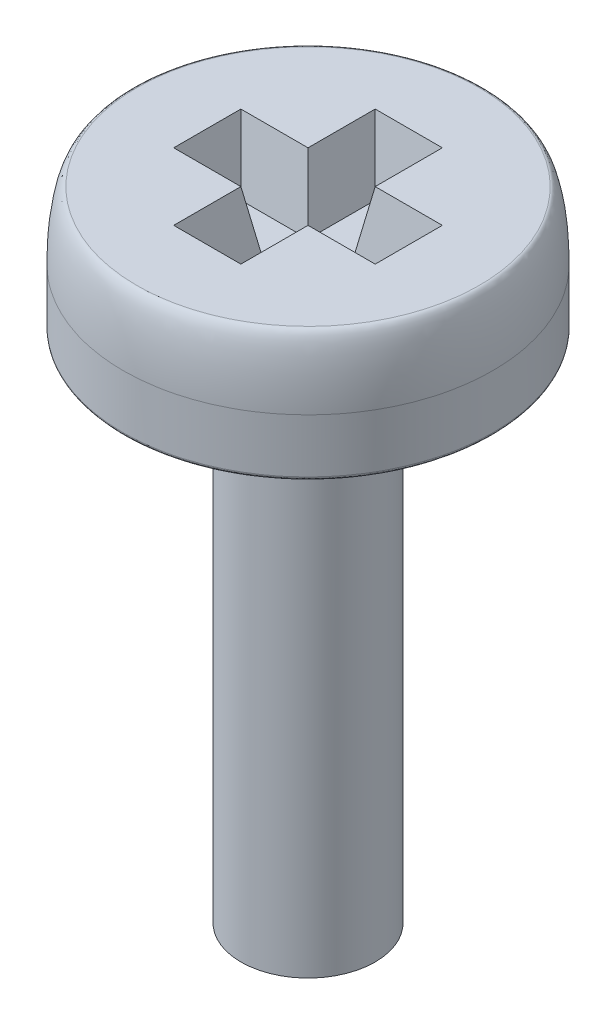
ISO-10303-21;
HEADER;
FILE_DESCRIPTION(('STEP AP214'),'2;1');
FILE_NAME('part.step','',(''),(''),'','','');
FILE_SCHEMA(('AUTOMOTIVE_DESIGN { 1 0 10303 214 1 1 1 1 }'));
ENDSEC;
DATA;
#1=APPLICATION_CONTEXT('core data for automotive mechanical design processes');
#2=APPLICATION_PROTOCOL_DEFINITION('international standard','automotive_design',2000,#1);
#3=PRODUCT_CONTEXT('',#1,'mechanical');
#4=PRODUCT('Part','Part','',(#3));
#5=PRODUCT_RELATED_PRODUCT_CATEGORY('part','',(#4));
#6=PRODUCT_DEFINITION_FORMATION('','',#4);
#7=PRODUCT_DEFINITION_CONTEXT('part definition',#1,'design');
#8=PRODUCT_DEFINITION('design','',#6,#7);
#9=PRODUCT_DEFINITION_SHAPE('','',#8);
#10=(LENGTH_UNIT() NAMED_UNIT(*) SI_UNIT(.MILLI.,.METRE.));
#11=(NAMED_UNIT(*) PLANE_ANGLE_UNIT() SI_UNIT($,.RADIAN.));
#12=(NAMED_UNIT(*) SI_UNIT($,.STERADIAN.) SOLID_ANGLE_UNIT());
#13=UNCERTAINTY_MEASURE_WITH_UNIT(LENGTH_MEASURE(1.E-05),#10,'distance_accuracy_value','');
#14=(GEOMETRIC_REPRESENTATION_CONTEXT(3) GLOBAL_UNCERTAINTY_ASSIGNED_CONTEXT((#13)) GLOBAL_UNIT_ASSIGNED_CONTEXT((#10,
#11,#12)) REPRESENTATION_CONTEXT('',''));
#15=CARTESIAN_POINT('',(0.,0.,0.));
#16=DIRECTION('',(0.,0.,1.));
#17=DIRECTION('',(1.,0.,0.));
#18=AXIS2_PLACEMENT_3D('',#15,#16,#17);
#19=CARTESIAN_POINT('',(0.,2.,0.));
#20=DIRECTION('',(0.,-1.,0.));
#21=DIRECTION('',(0.,0.,-1.));
#22=AXIS2_PLACEMENT_3D('',#19,#20,#21);
#23=CYLINDRICAL_SURFACE('',#22,2.75);
#24=CARTESIAN_POINT('',(0.,1.,2.75));
#25=CARTESIAN_POINT('',(0.359974148997221,1.,2.75));
#26=CARTESIAN_POINT('',(0.719806690512289,1.,2.678424857307));
#27=CARTESIAN_POINT('',(1.3849521874957,1.,2.40291257150508));
#28=CARTESIAN_POINT('',(1.6900034864552,1.,2.19908381007081));
#29=CARTESIAN_POINT('',(2.19908381007081,1.,1.6900034864552));
#30=CARTESIAN_POINT('',(2.40291257150507,1.,1.38495218749572));
#31=CARTESIAN_POINT('',(2.67842485730701,1.,0.719806690512269));
#32=CARTESIAN_POINT('',(2.75,1.,0.359974148997273));
#33=CARTESIAN_POINT('',(2.75,1.,-0.359974148997272));
#34=CARTESIAN_POINT('',(2.67842485730702,1.,-0.71980669051224));
#35=CARTESIAN_POINT('',(2.40291257150506,1.,-1.38495218749576));
#36=CARTESIAN_POINT('',(2.19908381007078,1.,-1.69000348645523));
#37=CARTESIAN_POINT('',(1.69000348645523,1.,-2.19908381007078));
#38=CARTESIAN_POINT('',(1.38495218749573,1.,-2.40291257150507));
#39=CARTESIAN_POINT('',(0.719806690512274,1.,-2.67842485730701));
#40=CARTESIAN_POINT('',(0.359974148997273,1.,-2.75));
#41=CARTESIAN_POINT('',(-0.359974148997272,1.,-2.75));
#42=CARTESIAN_POINT('',(-0.719806690512236,1.,-2.67842485730702));
#43=CARTESIAN_POINT('',(-1.38495218749575,1.,-2.40291257150506));
#44=CARTESIAN_POINT('',(-1.6900034864552,1.,-2.19908381007081));
#45=CARTESIAN_POINT('',(-2.19908381007082,1.,-1.69000348645519));
#46=CARTESIAN_POINT('',(-2.40291257150506,1.,-1.38495218749574));
#47=CARTESIAN_POINT('',(-2.67842485730701,1.,-0.719806690512258));
#48=CARTESIAN_POINT('',(-2.75,1.,-0.359974148997269));
#49=CARTESIAN_POINT('',(-2.75,1.,0.359974148997277));
#50=CARTESIAN_POINT('',(-2.67842485730702,1.,0.719806690512249));
#51=CARTESIAN_POINT('',(-2.40291257150506,1.,1.38495218749574));
#52=CARTESIAN_POINT('',(-2.1990838100708,1.,1.69000348645521));
#53=CARTESIAN_POINT('',(-1.69000348645522,1.,2.19908381007079));
#54=CARTESIAN_POINT('',(-1.38495218749574,1.,2.40291257150506));
#55=CARTESIAN_POINT('',(-0.719806690512258,1.,2.67842485730701));
#56=CARTESIAN_POINT('',(-0.359974148997222,1.,2.75));
#57=CARTESIAN_POINT('',(0.,1.,2.75));
#58=(BOUNDED_CURVE() B_SPLINE_CURVE(3,(#24,#25,#26,#27,#28,#29,#30,#31,#32,#33,#34,#35,#36,#37,
#38,#39,#40,#41,#42,#43,#44,#45,#46,#47,#48,#49,#50,#51,#52,#53,#54,#55,#56,#57),.UNSPECIFIED.,
.T.,.F.) B_SPLINE_CURVE_WITH_KNOTS((4,2,2,2,2,2,2,2,2,2,2,2,2,2,2,2,4),(0.,0.392699081698724,
0.785398163397448,1.17809724509617,1.5707963267949,1.96349540849362,2.35619449019234,
2.74889357189107,3.14159265358979,3.53429173528852,3.92699081698724,4.31968989868597,
4.71238898038469,5.10508806208341,5.49778714378214,5.89048622548086,6.28318530717959),
.UNSPECIFIED.) CURVE() GEOMETRIC_REPRESENTATION_ITEM() RATIONAL_B_SPLINE_CURVE((1.,1.,1.,1.,1.,
1.,1.,1.,1.,1.,1.,1.,1.,1.,1.,1.,1.,1.,1.,1.,1.,1.,1.,1.,1.,1.,1.,1.,1.,1.,1.,1.,1.,1.)) REPRESENTATION_ITEM(''));
#59=CARTESIAN_POINT('',(0.,1.,2.75));
#60=VERTEX_POINT('',#59);
#61=EDGE_CURVE('E337',#60,#60,#58,.F.);
#62=ORIENTED_EDGE('',*,*,#61,.T.);
#63=EDGE_LOOP('',(#62));
#64=FACE_BOUND('',#63,.T.);
#65=CARTESIAN_POINT('',(0.,0.2,2.75));
#66=CARTESIAN_POINT('',(-0.359974138633578,0.2,2.75));
#67=CARTESIAN_POINT('',(-0.71980670008718,0.2,2.67842485334095));
#68=CARTESIAN_POINT('',(-1.38495217792082,0.2,2.40291257547112));
#69=CARTESIAN_POINT('',(-1.69000349378355,0.2,2.19908380274246));
#70=CARTESIAN_POINT('',(-2.19908380274247,0.2,1.69000349378354));
#71=CARTESIAN_POINT('',(-2.40291257547116,0.2,1.38495217792074));
#72=CARTESIAN_POINT('',(-2.67842485334092,0.2,0.719806700087249));
#73=CARTESIAN_POINT('',(-2.75,0.2,0.359974138633405));
#74=CARTESIAN_POINT('',(-2.75,0.2,-0.359974138633396));
#75=CARTESIAN_POINT('',(-2.67842485334093,0.2,-0.719806700087222));
#76=CARTESIAN_POINT('',(-2.40291257547114,0.2,-1.38495217792078));
#77=CARTESIAN_POINT('',(-2.19908380274248,0.2,-1.69000349378353));
#78=CARTESIAN_POINT('',(-1.69000349378354,0.2,-2.19908380274248));
#79=CARTESIAN_POINT('',(-1.38495217792079,0.2,-2.40291257547114));
#80=CARTESIAN_POINT('',(-0.719806700087199,0.2,-2.67842485334094));
#81=CARTESIAN_POINT('',(-0.3599741386334,0.2,-2.75));
#82=CARTESIAN_POINT('',(0.359974138633401,0.2,-2.75));
#83=CARTESIAN_POINT('',(0.719806700087225,0.2,-2.67842485334093));
#84=CARTESIAN_POINT('',(1.38495217792078,0.2,-2.40291257547114));
#85=CARTESIAN_POINT('',(1.69000349378355,0.2,-2.19908380274247));
#86=CARTESIAN_POINT('',(2.19908380274246,0.2,-1.69000349378355));
#87=CARTESIAN_POINT('',(2.40291257547113,0.2,-1.3849521779208));
#88=CARTESIAN_POINT('',(2.67842485334095,0.2,-0.719806700087193));
#89=CARTESIAN_POINT('',(2.75,0.2,-0.3599741386334));
#90=CARTESIAN_POINT('',(2.75,0.2,0.3599741386334));
#91=CARTESIAN_POINT('',(2.67842485334094,0.2,0.719806700087204));
#92=CARTESIAN_POINT('',(2.40291257547114,0.2,1.38495217792079));
#93=CARTESIAN_POINT('',(2.19908380274249,0.2,1.69000349378352));
#94=CARTESIAN_POINT('',(1.69000349378352,0.2,2.19908380274249));
#95=CARTESIAN_POINT('',(1.38495217792077,0.2,2.40291257547114));
#96=CARTESIAN_POINT('',(0.719806700087226,0.2,2.67842485334093));
#97=CARTESIAN_POINT('',(0.359974138633578,0.2,2.75));
#98=CARTESIAN_POINT('',(0.,0.2,2.75));
#99=(BOUNDED_CURVE() B_SPLINE_CURVE(3,(#65,#66,#67,#68,#69,#70,#71,#72,#73,#74,#75,#76,#77,#78,
#79,#80,#81,#82,#83,#84,#85,#86,#87,#88,#89,#90,#91,#92,#93,#94,#95,#96,#97,#98),.UNSPECIFIED.,
.T.,.F.) B_SPLINE_CURVE_WITH_KNOTS((4,2,2,2,2,2,2,2,2,2,2,2,2,2,2,2,4),(0.,0.392699081698725,
0.785398163397448,1.17809724509617,1.5707963267949,1.96349540849362,2.35619449019234,
2.74889357189107,3.14159265358979,3.53429173528852,3.92699081698724,4.31968989868597,
4.71238898038469,5.10508806208341,5.49778714378214,5.89048622548086,6.28318530717959),
.UNSPECIFIED.) CURVE() GEOMETRIC_REPRESENTATION_ITEM() RATIONAL_B_SPLINE_CURVE((1.,1.,1.,1.,1.,
1.,1.,1.,1.,1.,1.,1.,1.,1.,1.,1.,1.,1.,1.,1.,1.,1.,1.,1.,1.,1.,1.,1.,1.,1.,1.,1.,1.,1.)) REPRESENTATION_ITEM(''));
#100=CARTESIAN_POINT('',(0.,0.2,2.75));
#101=VERTEX_POINT('',#100);
#102=EDGE_CURVE('E318',#101,#101,#99,.F.);
#103=ORIENTED_EDGE('',*,*,#102,.T.);
#104=EDGE_LOOP('',(#103));
#105=FACE_BOUND('',#104,.T.);
#106=ADVANCED_FACE('F41',(#64,#105),#23,.T.);
#107=CARTESIAN_POINT('',(0.,2.,0.));
#108=DIRECTION('',(0.,1.,0.));
#109=DIRECTION('',(0.,0.,1.));
#110=AXIS2_PLACEMENT_3D('',#107,#108,#109);
#111=PLANE('',#110);
#112=DIRECTION('',(0.,0.,-1.));
#113=VECTOR('',#112,1.);
#114=CARTESIAN_POINT('',(0.5,2.,-1.5));
#115=LINE('',#114,#113);
#116=CARTESIAN_POINT('',(0.5,2.,-0.5));
#117=VERTEX_POINT('',#116);
#118=CARTESIAN_POINT('',(0.5,2.,-1.5));
#119=VERTEX_POINT('',#118);
#120=EDGE_CURVE('E60',#117,#119,#115,.T.);
#121=ORIENTED_EDGE('',*,*,#120,.F.);
#122=DIRECTION('',(-1.,0.,0.));
#123=VECTOR('',#122,1.);
#124=CARTESIAN_POINT('',(0.5,2.,-0.5));
#125=LINE('',#124,#123);
#126=CARTESIAN_POINT('',(1.5,2.,-0.5));
#127=VERTEX_POINT('',#126);
#128=EDGE_CURVE('E185',#127,#117,#125,.T.);
#129=ORIENTED_EDGE('',*,*,#128,.F.);
#130=DIRECTION('',(0.,0.,-1.));
#131=VECTOR('',#130,1.);
#132=CARTESIAN_POINT('',(1.5,2.,-0.5));
#133=LINE('',#132,#131);
#134=CARTESIAN_POINT('',(1.5,2.,0.5));
#135=VERTEX_POINT('',#134);
#136=EDGE_CURVE('E183',#135,#127,#133,.T.);
#137=ORIENTED_EDGE('',*,*,#136,.F.);
#138=DIRECTION('',(1.,0.,0.));
#139=VECTOR('',#138,1.);
#140=CARTESIAN_POINT('',(0.5,2.,0.5));
#141=LINE('',#140,#139);
#142=CARTESIAN_POINT('',(0.5,2.,0.5));
#143=VERTEX_POINT('',#142);
#144=EDGE_CURVE('E180',#143,#135,#141,.T.);
#145=ORIENTED_EDGE('',*,*,#144,.F.);
#146=DIRECTION('',(0.,0.,-1.));
#147=VECTOR('',#146,1.);
#148=CARTESIAN_POINT('',(0.5,2.,0.5));
#149=LINE('',#148,#147);
#150=CARTESIAN_POINT('',(0.5,2.,1.5));
#151=VERTEX_POINT('',#150);
#152=EDGE_CURVE('E177',#151,#143,#149,.T.);
#153=ORIENTED_EDGE('',*,*,#152,.F.);
#154=DIRECTION('',(1.,0.,0.));
#155=VECTOR('',#154,1.);
#156=CARTESIAN_POINT('',(0.5,2.,1.5));
#157=LINE('',#156,#155);
#158=CARTESIAN_POINT('',(-0.5,2.,1.5));
#159=VERTEX_POINT('',#158);
#160=EDGE_CURVE('E174',#159,#151,#157,.T.);
#161=ORIENTED_EDGE('',*,*,#160,.F.);
#162=DIRECTION('',(0.,0.,1.));
#163=VECTOR('',#162,1.);
#164=CARTESIAN_POINT('',(-0.5,2.,0.5));
#165=LINE('',#164,#163);
#166=CARTESIAN_POINT('',(-0.5,2.,0.5));
#167=VERTEX_POINT('',#166);
#168=EDGE_CURVE('E171',#167,#159,#165,.T.);
#169=ORIENTED_EDGE('',*,*,#168,.F.);
#170=DIRECTION('',(1.,0.,0.));
#171=VECTOR('',#170,1.);
#172=CARTESIAN_POINT('',(-1.5,2.,0.5));
#173=LINE('',#172,#171);
#174=CARTESIAN_POINT('',(-1.5,2.,0.5));
#175=VERTEX_POINT('',#174);
#176=EDGE_CURVE('E168',#175,#167,#173,.T.);
#177=ORIENTED_EDGE('',*,*,#176,.F.);
#178=DIRECTION('',(0.,0.,1.));
#179=VECTOR('',#178,1.);
#180=CARTESIAN_POINT('',(-1.5,2.,-0.5));
#181=LINE('',#180,#179);
#182=CARTESIAN_POINT('',(-1.5,2.,-0.5));
#183=VERTEX_POINT('',#182);
#184=EDGE_CURVE('E162',#183,#175,#181,.T.);
#185=ORIENTED_EDGE('',*,*,#184,.F.);
#186=DIRECTION('',(-1.,0.,0.));
#187=VECTOR('',#186,1.);
#188=CARTESIAN_POINT('',(-1.5,2.,-0.5));
#189=LINE('',#188,#187);
#190=CARTESIAN_POINT('',(-0.5,2.,-0.5));
#191=VERTEX_POINT('',#190);
#192=EDGE_CURVE('E160',#191,#183,#189,.T.);
#193=ORIENTED_EDGE('',*,*,#192,.F.);
#194=DIRECTION('',(0.,0.,1.));
#195=VECTOR('',#194,1.);
#196=CARTESIAN_POINT('',(-0.5,2.,-1.5));
#197=LINE('',#196,#195);
#198=CARTESIAN_POINT('',(-0.5,2.,-1.5));
#199=VERTEX_POINT('',#198);
#200=EDGE_CURVE('E143',#199,#191,#197,.T.);
#201=ORIENTED_EDGE('',*,*,#200,.F.);
#202=DIRECTION('',(-1.,0.,0.));
#203=VECTOR('',#202,1.);
#204=CARTESIAN_POINT('',(0.5,2.,-1.5));
#205=LINE('',#204,#203);
#206=EDGE_CURVE('E152',#119,#199,#205,.T.);
#207=ORIENTED_EDGE('',*,*,#206,.F.);
#208=EDGE_LOOP('',(#121,#129,#137,#145,#153,#161,#169,#177,#185,#193,#201,#207));
#209=FACE_BOUND('',#208,.T.);
#210=CARTESIAN_POINT('',(0.,2.,2.55));
#211=CARTESIAN_POINT('',(-0.333794210888333,2.,2.55));
#212=CARTESIAN_POINT('',(-0.667457113020464,2.,2.48363032223014));
#213=CARTESIAN_POINT('',(-1.2842283920415,2.,2.22815529357742));
#214=CARTESIAN_POINT('',(-1.56709414198576,2.,2.03915044206566));
#215=CARTESIAN_POINT('',(-2.03915044206564,2.,1.56709414198572));
#216=CARTESIAN_POINT('',(-2.22815529357742,2.,1.28422839204149));
#217=CARTESIAN_POINT('',(-2.48363032223015,2.,0.667457113020457));
#218=CARTESIAN_POINT('',(-2.55,2.,0.333794210888384));
#219=CARTESIAN_POINT('',(-2.55,2.,-0.333794210888376));
#220=CARTESIAN_POINT('',(-2.48363032223014,2.,-0.667457113020464));
#221=CARTESIAN_POINT('',(-2.22815529357742,2.,-1.2842283920415));
#222=CARTESIAN_POINT('',(-2.03915044206569,2.,-1.56709414198573));
#223=CARTESIAN_POINT('',(-1.5670941419857,2.,-2.03915044206566));
#224=CARTESIAN_POINT('',(-1.28422839204151,2.,-2.22815529357742));
#225=CARTESIAN_POINT('',(-0.667457113020445,2.,-2.48363032223015));
#226=CARTESIAN_POINT('',(-0.33379421088838,2.,-2.55));
#227=CARTESIAN_POINT('',(0.33379421088838,2.,-2.55));
#228=CARTESIAN_POINT('',(0.66745711302047,2.,-2.48363032223014));
#229=CARTESIAN_POINT('',(1.28422839204149,2.,-2.22815529357742));
#230=CARTESIAN_POINT('',(1.56709414198577,2.,-2.03915044206566));
#231=CARTESIAN_POINT('',(2.03915044206562,2.,-1.56709414198574));
#232=CARTESIAN_POINT('',(2.22815529357742,2.,-1.28422839204153));
#233=CARTESIAN_POINT('',(2.48363032223014,2.,-0.667457113020431));
#234=CARTESIAN_POINT('',(2.55,2.,-0.33379421088838));
#235=CARTESIAN_POINT('',(2.55,2.,0.33379421088838));
#236=CARTESIAN_POINT('',(2.48363032223014,2.,0.667457113020465));
#237=CARTESIAN_POINT('',(2.22815529357742,2.,1.28422839204149));
#238=CARTESIAN_POINT('',(2.03915044206569,2.,1.56709414198574));
#239=CARTESIAN_POINT('',(1.5670941419857,2.,2.03915044206565));
#240=CARTESIAN_POINT('',(1.28422839204149,2.,2.22815529357745));
#241=CARTESIAN_POINT('',(0.667457113020469,2.,2.48363032223011));
#242=CARTESIAN_POINT('',(0.333794210888332,2.,2.55));
#243=CARTESIAN_POINT('',(0.,2.,2.55));
#244=(BOUNDED_CURVE() B_SPLINE_CURVE(3,(#210,#211,#212,#213,#214,#215,#216,#217,#218,#219,#220,
#221,#222,#223,#224,#225,#226,#227,#228,#229,#230,#231,#232,#233,#234,#235,#236,#237,#238,#239,
#240,#241,#242,#243),.UNSPECIFIED.,.T.,.F.) B_SPLINE_CURVE_WITH_KNOTS((4,2,2,2,2,2,2,2,2,2,2,2,
2,2,2,2,4),(0.,0.392699081698725,0.785398163397448,1.17809724509617,1.5707963267949,
1.96349540849362,2.35619449019234,2.74889357189107,3.14159265358979,3.53429173528852,
3.92699081698724,4.31968989868597,4.71238898038469,5.10508806208341,5.49778714378214,
5.89048622548086,6.28318530717959),
.UNSPECIFIED.) CURVE() GEOMETRIC_REPRESENTATION_ITEM() RATIONAL_B_SPLINE_CURVE((1.,1.,1.,1.,1.,
1.,1.,1.,1.,1.,1.,1.,1.,1.,1.,1.,1.,1.,1.,1.,1.,1.,1.,1.,1.,1.,1.,1.,1.,1.,1.,1.,1.,1.)) REPRESENTATION_ITEM(''));
#245=CARTESIAN_POINT('',(0.,2.,2.55));
#246=VERTEX_POINT('',#245);
#247=EDGE_CURVE('E241',#246,#246,#244,.F.);
#248=ORIENTED_EDGE('',*,*,#247,.T.);
#249=EDGE_LOOP('',(#248));
#250=FACE_BOUND('',#249,.T.);
#251=ADVANCED_FACE('F156',(#209,#250),#111,.T.);
#252=CARTESIAN_POINT('',(0.,0.,0.));
#253=DIRECTION('',(0.,1.,0.));
#254=DIRECTION('',(0.,0.,1.));
#255=AXIS2_PLACEMENT_3D('',#252,#253,#254);
#256=PLANE('',#255);
#257=CARTESIAN_POINT('',(0.,0.,0.));
#258=DIRECTION('',(0.,1.,0.));
#259=DIRECTION('',(0.,0.,1.));
#260=AXIS2_PLACEMENT_3D('',#257,#258,#259);
#261=CIRCLE('',#260,1.);
#262=CARTESIAN_POINT('',(0.,0.,1.));
#263=VERTEX_POINT('',#262);
#264=EDGE_CURVE('E12',#263,#263,#261,.F.);
#265=ORIENTED_EDGE('',*,*,#264,.F.);
#266=EDGE_LOOP('',(#265));
#267=FACE_BOUND('',#266,.T.);
#268=CARTESIAN_POINT('',(0.,0.,1.75));
#269=CARTESIAN_POINT('',(0.229074451857731,0.,1.75));
#270=CARTESIAN_POINT('',(0.45805880914641,0.,1.70445217939875));
#271=CARTESIAN_POINT('',(0.881333204131404,0.,1.52912618439075));
#272=CARTESIAN_POINT('',(1.07545676877133,0.,1.39941696538156));
#273=CARTESIAN_POINT('',(1.39941696538159,0.,1.07545676877135));
#274=CARTESIAN_POINT('',(1.52912618439074,0.,0.881333204131412));
#275=CARTESIAN_POINT('',(1.70445217939876,0.,0.458058809146401));
#276=CARTESIAN_POINT('',(1.75,0.,0.229074451857619));
#277=CARTESIAN_POINT('',(1.75,0.,-0.229074451857618));
#278=CARTESIAN_POINT('',(1.70445217939879,0.,-0.458058809146415));
#279=CARTESIAN_POINT('',(1.52912618439072,0.,-0.881333204131401));
#280=CARTESIAN_POINT('',(1.39941696538157,0.,-1.07545676877135));
#281=CARTESIAN_POINT('',(1.07545676877135,0.,-1.39941696538157));
#282=CARTESIAN_POINT('',(0.88133320413141,0.,-1.52912618439073));
#283=CARTESIAN_POINT('',(0.458058809146409,0.,-1.70445217939877));
#284=CARTESIAN_POINT('',(0.229074451857619,0.,-1.75));
#285=CARTESIAN_POINT('',(-0.229074451857618,0.,-1.75));
#286=CARTESIAN_POINT('',(-0.458058809146404,0.,-1.70445217939877));
#287=CARTESIAN_POINT('',(-0.881333204131405,0.,-1.52912618439073));
#288=CARTESIAN_POINT('',(-1.07545676877135,0.,-1.39941696538157));
#289=CARTESIAN_POINT('',(-1.39941696538157,0.,-1.07545676877135));
#290=CARTESIAN_POINT('',(-1.52912618439072,0.,-0.881333204131394));
#291=CARTESIAN_POINT('',(-1.70445217939878,0.,-0.458058809146424));
#292=CARTESIAN_POINT('',(-1.75,0.,-0.229074451857616));
#293=CARTESIAN_POINT('',(-1.75,0.,0.229074451857621));
#294=CARTESIAN_POINT('',(-1.70445217939878,0.,0.458058809146419));
#295=CARTESIAN_POINT('',(-1.52912618439073,0.,0.881333204131389));
#296=CARTESIAN_POINT('',(-1.39941696538157,0.,1.07545676877135));
#297=CARTESIAN_POINT('',(-1.07545676877135,0.,1.39941696538156));
#298=CARTESIAN_POINT('',(-0.881333204131419,0.,1.52912618439072));
#299=CARTESIAN_POINT('',(-0.458058809146399,0.,1.70445217939878));
#300=CARTESIAN_POINT('',(-0.229074451857731,0.,1.75));
#301=CARTESIAN_POINT('',(0.,0.,1.75));
#302=(BOUNDED_CURVE() B_SPLINE_CURVE(3,(#268,#269,#270,#271,#272,#273,#274,#275,#276,#277,#278,
#279,#280,#281,#282,#283,#284,#285,#286,#287,#288,#289,#290,#291,#292,#293,#294,#295,#296,#297,
#298,#299,#300,#301),.UNSPECIFIED.,.T.,.F.) B_SPLINE_CURVE_WITH_KNOTS((4,2,2,2,2,2,2,2,2,2,2,2,
2,2,2,2,4),(0.,0.392699081698724,0.785398163397448,1.17809724509617,1.5707963267949,
1.96349540849362,2.35619449019234,2.74889357189107,3.14159265358979,3.53429173528852,
3.92699081698724,4.31968989868597,4.71238898038469,5.10508806208341,5.49778714378214,
5.89048622548086,6.28318530717959),
.UNSPECIFIED.) CURVE() GEOMETRIC_REPRESENTATION_ITEM() RATIONAL_B_SPLINE_CURVE((1.,1.,1.,1.,1.,
1.,1.,1.,1.,1.,1.,1.,1.,1.,1.,1.,1.,1.,1.,1.,1.,1.,1.,1.,1.,1.,1.,1.,1.,1.,1.,1.,1.,1.)) REPRESENTATION_ITEM(''));
#303=CARTESIAN_POINT('',(0.,0.,1.75));
#304=VERTEX_POINT('',#303);
#305=EDGE_CURVE('E53',#304,#304,#302,.F.);
#306=ORIENTED_EDGE('',*,*,#305,.T.);
#307=EDGE_LOOP('',(#306));
#308=FACE_BOUND('',#307,.T.);
#309=ADVANCED_FACE('F260',(#267,#308),#256,.F.);
#310=CARTESIAN_POINT('',(0.,2.,2.55));
#311=CARTESIAN_POINT('',(0.333794210888332,2.,2.55));
#312=CARTESIAN_POINT('',(0.667457113020469,2.,2.48363032223011));
#313=CARTESIAN_POINT('',(1.28422839204149,2.,2.22815529357745));
#314=CARTESIAN_POINT('',(1.5670941419857,2.,2.03915044206565));
#315=CARTESIAN_POINT('',(2.03915044206569,2.,1.56709414198574));
#316=CARTESIAN_POINT('',(2.22815529357742,2.,1.28422839204149));
#317=CARTESIAN_POINT('',(2.48363032223014,2.,0.667457113020465));
#318=CARTESIAN_POINT('',(2.55,2.,0.33379421088838));
#319=CARTESIAN_POINT('',(2.55,2.,-0.33379421088838));
#320=CARTESIAN_POINT('',(2.48363032223014,2.,-0.667457113020431));
#321=CARTESIAN_POINT('',(2.22815529357742,2.,-1.28422839204153));
#322=CARTESIAN_POINT('',(2.03915044206562,2.,-1.56709414198574));
#323=CARTESIAN_POINT('',(1.56709414198577,2.,-2.03915044206566));
#324=CARTESIAN_POINT('',(1.28422839204149,2.,-2.22815529357742));
#325=CARTESIAN_POINT('',(0.66745711302047,2.,-2.48363032223014));
#326=CARTESIAN_POINT('',(0.33379421088838,2.,-2.55));
#327=CARTESIAN_POINT('',(-0.33379421088838,2.,-2.55));
#328=CARTESIAN_POINT('',(-0.667457113020445,2.,-2.48363032223015));
#329=CARTESIAN_POINT('',(-1.28422839204151,2.,-2.22815529357742));
#330=CARTESIAN_POINT('',(-1.5670941419857,2.,-2.03915044206566));
#331=CARTESIAN_POINT('',(-2.03915044206569,2.,-1.56709414198573));
#332=CARTESIAN_POINT('',(-2.22815529357742,2.,-1.2842283920415));
#333=CARTESIAN_POINT('',(-2.48363032223014,2.,-0.667457113020464));
#334=CARTESIAN_POINT('',(-2.55,2.,-0.333794210888376));
#335=CARTESIAN_POINT('',(-2.55,2.,0.333794210888384));
#336=CARTESIAN_POINT('',(-2.48363032223015,2.,0.667457113020457));
#337=CARTESIAN_POINT('',(-2.22815529357742,2.,1.28422839204149));
#338=CARTESIAN_POINT('',(-2.03915044206564,2.,1.56709414198572));
#339=CARTESIAN_POINT('',(-1.56709414198576,2.,2.03915044206566));
#340=CARTESIAN_POINT('',(-1.2842283920415,2.,2.22815529357742));
#341=CARTESIAN_POINT('',(-0.667457113020464,2.,2.48363032223014));
#342=CARTESIAN_POINT('',(-0.333794210888333,2.,2.55));
#343=CARTESIAN_POINT('',(0.,2.,2.55));
#344=CARTESIAN_POINT('',(0.,2.,2.75));
#345=CARTESIAN_POINT('',(0.359974148997221,1.99999999999986,2.75));
#346=CARTESIAN_POINT('',(0.719806690512251,2.,2.67842485730691));
#347=CARTESIAN_POINT('',(1.38495218749574,2.,2.40291257150517));
#348=CARTESIAN_POINT('',(1.69000348645521,2.,2.1990838100708));
#349=CARTESIAN_POINT('',(2.1990838100708,2.,1.69000348645521));
#350=CARTESIAN_POINT('',(2.40291257150506,2.,1.38495218749572));
#351=CARTESIAN_POINT('',(2.67842485730702,2.,0.719806690512272));
#352=CARTESIAN_POINT('',(2.75,2.,0.359974148997273));
#353=CARTESIAN_POINT('',(2.75,2.,-0.359974148997272));
#354=CARTESIAN_POINT('',(2.67842485730701,2.,-0.719806690512238));
#355=CARTESIAN_POINT('',(2.40291257150506,2.,-1.38495218749576));
#356=CARTESIAN_POINT('',(2.19908381007076,2.,-1.69000348645518));
#357=CARTESIAN_POINT('',(1.69000348645525,2.,-2.19908381007083));
#358=CARTESIAN_POINT('',(1.38495218749572,2.,-2.40291257150506));
#359=CARTESIAN_POINT('',(0.719806690512277,2.,-2.67842485730701));
#360=CARTESIAN_POINT('',(0.359974148997273,2.,-2.75));
#361=CARTESIAN_POINT('',(-0.359974148997272,2.,-2.75));
#362=CARTESIAN_POINT('',(-0.719806690512233,2.,-2.67842485730702));
#363=CARTESIAN_POINT('',(-1.38495218749575,2.,-2.40291257150506));
#364=CARTESIAN_POINT('',(-1.69000348645518,2.,-2.1990838100708));
#365=CARTESIAN_POINT('',(-2.19908381007083,2.,-1.69000348645521));
#366=CARTESIAN_POINT('',(-2.40291257150505,2.,-1.38495218749574));
#367=CARTESIAN_POINT('',(-2.67842485730702,2.,-0.719806690512262));
#368=CARTESIAN_POINT('',(-2.75,2.,-0.359974148997269));
#369=CARTESIAN_POINT('',(-2.75,2.,0.359974148997277));
#370=CARTESIAN_POINT('',(-2.67842485730703,2.,0.719806690512254));
#371=CARTESIAN_POINT('',(-2.40291257150505,2.,1.38495218749573));
#372=CARTESIAN_POINT('',(-2.19908381007084,2.,1.69000348645517));
#373=CARTESIAN_POINT('',(-1.69000348645519,2.,2.19908381007083));
#374=CARTESIAN_POINT('',(-1.38495218749574,2.,2.40291257150505));
#375=CARTESIAN_POINT('',(-0.719806690512262,2.,2.67842485730702));
#376=CARTESIAN_POINT('',(-0.359974148997222,2.00000000000014,2.75));
#377=CARTESIAN_POINT('',(0.,2.,2.75));
#378=CARTESIAN_POINT('',(0.,1.,2.75));
#379=CARTESIAN_POINT('',(0.359974148997221,1.,2.75));
#380=CARTESIAN_POINT('',(0.719806690512289,1.,2.678424857307));
#381=CARTESIAN_POINT('',(1.3849521874957,1.,2.40291257150508));
#382=CARTESIAN_POINT('',(1.6900034864552,1.,2.19908381007081));
#383=CARTESIAN_POINT('',(2.19908381007081,1.,1.6900034864552));
#384=CARTESIAN_POINT('',(2.40291257150507,1.,1.38495218749572));
#385=CARTESIAN_POINT('',(2.67842485730701,1.,0.719806690512269));
#386=CARTESIAN_POINT('',(2.75,1.,0.359974148997273));
#387=CARTESIAN_POINT('',(2.75,1.,-0.359974148997272));
#388=CARTESIAN_POINT('',(2.67842485730702,1.,-0.71980669051224));
#389=CARTESIAN_POINT('',(2.40291257150506,1.,-1.38495218749576));
#390=CARTESIAN_POINT('',(2.19908381007078,1.,-1.69000348645523));
#391=CARTESIAN_POINT('',(1.69000348645523,1.,-2.19908381007078));
#392=CARTESIAN_POINT('',(1.38495218749573,1.,-2.40291257150507));
#393=CARTESIAN_POINT('',(0.719806690512274,1.,-2.67842485730701));
#394=CARTESIAN_POINT('',(0.359974148997273,1.,-2.75));
#395=CARTESIAN_POINT('',(-0.359974148997272,1.,-2.75));
#396=CARTESIAN_POINT('',(-0.719806690512236,1.,-2.67842485730702));
#397=CARTESIAN_POINT('',(-1.38495218749575,1.,-2.40291257150506));
#398=CARTESIAN_POINT('',(-1.6900034864552,1.,-2.19908381007081));
#399=CARTESIAN_POINT('',(-2.19908381007082,1.,-1.69000348645519));
#400=CARTESIAN_POINT('',(-2.40291257150506,1.,-1.38495218749574));
#401=CARTESIAN_POINT('',(-2.67842485730701,1.,-0.719806690512258));
#402=CARTESIAN_POINT('',(-2.75,1.,-0.359974148997269));
#403=CARTESIAN_POINT('',(-2.75,1.,0.359974148997277));
#404=CARTESIAN_POINT('',(-2.67842485730702,1.,0.719806690512249));
#405=CARTESIAN_POINT('',(-2.40291257150506,1.,1.38495218749574));
#406=CARTESIAN_POINT('',(-2.1990838100708,1.,1.69000348645521));
#407=CARTESIAN_POINT('',(-1.69000348645522,1.,2.19908381007079));
#408=CARTESIAN_POINT('',(-1.38495218749574,1.,2.40291257150506));
#409=CARTESIAN_POINT('',(-0.719806690512258,1.,2.67842485730701));
#410=CARTESIAN_POINT('',(-0.359974148997222,1.,2.75));
#411=CARTESIAN_POINT('',(0.,1.,2.75));
#412=(BOUNDED_SURFACE() B_SPLINE_SURFACE(2,3,((#310,#311,#312,#313,#314,#315,#316,#317,#318,
#319,#320,#321,#322,#323,#324,#325,#326,#327,#328,#329,#330,#331,#332,#333,#334,#335,#336,#337,
#338,#339,#340,#341,#342,#343),(#344,#345,#346,#347,#348,#349,#350,#351,#352,#353,#354,#355,
#356,#357,#358,#359,#360,#361,#362,#363,#364,#365,#366,#367,#368,#369,#370,#371,#372,#373,#374,
#375,#376,#377),(#378,#379,#380,#381,#382,#383,#384,#385,#386,#387,#388,#389,#390,#391,#392,
#393,#394,#395,#396,#397,#398,#399,#400,#401,#402,#403,#404,#405,#406,#407,#408,#409,#410,
#411)),.UNSPECIFIED.,.F.,.T.,.F.) B_SPLINE_SURFACE_WITH_KNOTS((3,3),(4,2,2,2,2,2,2,2,2,2,2,2,2,
2,2,2,4),(0.,1.),(0.,0.392699081698724,0.785398163397448,1.17809724509617,1.5707963267949,
1.96349540849362,2.35619449019234,2.74889357189107,3.14159265358979,3.53429173528852,
3.92699081698724,4.31968989868597,4.71238898038469,5.10508806208341,5.49778714378214,
5.89048622548086,6.28318530717959),
.UNSPECIFIED.) GEOMETRIC_REPRESENTATION_ITEM() RATIONAL_B_SPLINE_SURFACE(((1.,1.,1.,1.,1.,1.,1.,
1.,1.,1.,1.,1.,1.,1.,1.,1.,1.,1.,1.,1.,1.,1.,1.,1.,1.,1.,1.,1.,1.,1.,1.,1.,1.,1.),
(0.707106781186548,0.707106781186548,0.707106781186548,0.707106781186548,0.707106781186548,
0.707106781186548,0.707106781186548,0.707106781186548,0.707106781186548,0.707106781186548,
0.707106781186548,0.707106781186548,0.707106781186547,0.707106781186547,0.707106781186548,
0.707106781186548,0.707106781186548,0.707106781186548,0.707106781186548,0.707106781186548,
0.707106781186548,0.707106781186548,0.707106781186548,0.707106781186548,0.707106781186548,
0.707106781186548,0.707106781186548,0.707106781186548,0.707106781186548,0.707106781186548,
0.707106781186548,0.707106781186548,0.707106781186548,0.707106781186548),(1.,1.,1.,1.,1.,1.,1.,
1.,1.,1.,1.,1.,1.,1.,1.,1.,1.,1.,1.,1.,1.,1.,1.,1.,1.,1.,1.,1.,1.,1.,1.,1.,1.,1.))) REPRESENTATION_ITEM('') SURFACE());
#413=ORIENTED_EDGE('',*,*,#61,.F.);
#414=EDGE_LOOP('',(#413));
#415=FACE_BOUND('',#414,.T.);
#416=ORIENTED_EDGE('',*,*,#247,.F.);
#417=EDGE_LOOP('',(#416));
#418=FACE_BOUND('',#417,.T.);
#419=ADVANCED_FACE('F266',(#415,#418),#412,.T.);
#420=CARTESIAN_POINT('',(0.,0.2,2.75));
#421=CARTESIAN_POINT('',(0.359974138633578,0.2,2.75));
#422=CARTESIAN_POINT('',(0.719806700087226,0.2,2.67842485334093));
#423=CARTESIAN_POINT('',(1.38495217792077,0.2,2.40291257547114));
#424=CARTESIAN_POINT('',(1.69000349378352,0.2,2.19908380274249));
#425=CARTESIAN_POINT('',(2.19908380274249,0.2,1.69000349378352));
#426=CARTESIAN_POINT('',(2.40291257547114,0.2,1.38495217792079));
#427=CARTESIAN_POINT('',(2.67842485334094,0.2,0.719806700087204));
#428=CARTESIAN_POINT('',(2.75,0.2,0.3599741386334));
#429=CARTESIAN_POINT('',(2.75,0.2,-0.3599741386334));
#430=CARTESIAN_POINT('',(2.67842485334095,0.2,-0.719806700087193));
#431=CARTESIAN_POINT('',(2.40291257547113,0.2,-1.3849521779208));
#432=CARTESIAN_POINT('',(2.19908380274246,0.2,-1.69000349378355));
#433=CARTESIAN_POINT('',(1.69000349378355,0.2,-2.19908380274247));
#434=CARTESIAN_POINT('',(1.38495217792078,0.2,-2.40291257547114));
#435=CARTESIAN_POINT('',(0.719806700087225,0.2,-2.67842485334093));
#436=CARTESIAN_POINT('',(0.359974138633401,0.2,-2.75));
#437=CARTESIAN_POINT('',(-0.3599741386334,0.2,-2.75));
#438=CARTESIAN_POINT('',(-0.719806700087199,0.2,-2.67842485334094));
#439=CARTESIAN_POINT('',(-1.38495217792079,0.2,-2.40291257547114));
#440=CARTESIAN_POINT('',(-1.69000349378354,0.2,-2.19908380274248));
#441=CARTESIAN_POINT('',(-2.19908380274248,0.2,-1.69000349378353));
#442=CARTESIAN_POINT('',(-2.40291257547114,0.2,-1.38495217792078));
#443=CARTESIAN_POINT('',(-2.67842485334093,0.2,-0.719806700087222));
#444=CARTESIAN_POINT('',(-2.75,0.2,-0.359974138633396));
#445=CARTESIAN_POINT('',(-2.75,0.2,0.359974138633405));
#446=CARTESIAN_POINT('',(-2.67842485334092,0.2,0.719806700087249));
#447=CARTESIAN_POINT('',(-2.40291257547116,0.2,1.38495217792074));
#448=CARTESIAN_POINT('',(-2.19908380274247,0.2,1.69000349378354));
#449=CARTESIAN_POINT('',(-1.69000349378355,0.2,2.19908380274246));
#450=CARTESIAN_POINT('',(-1.38495217792082,0.2,2.40291257547112));
#451=CARTESIAN_POINT('',(-0.71980670008718,0.2,2.67842485334095));
#452=CARTESIAN_POINT('',(-0.359974138633578,0.2,2.75));
#453=CARTESIAN_POINT('',(0.,0.2,2.75));
#454=CARTESIAN_POINT('',(0.,0.,2.75));
#455=CARTESIAN_POINT('',(0.359974138633578,0.,2.75));
#456=CARTESIAN_POINT('',(0.719806700087221,0.,2.67842485334092));
#457=CARTESIAN_POINT('',(1.38495217792077,0.,2.40291257547116));
#458=CARTESIAN_POINT('',(1.6900034937835,0.,2.19908380274244));
#459=CARTESIAN_POINT('',(2.19908380274251,0.,1.69000349378357));
#460=CARTESIAN_POINT('',(2.40291257547118,0.,1.38495217792081));
#461=CARTESIAN_POINT('',(2.6784248533409,0.,0.719806700087186));
#462=CARTESIAN_POINT('',(2.75,0.,0.3599741386334));
#463=CARTESIAN_POINT('',(2.75,0.,-0.3599741386334));
#464=CARTESIAN_POINT('',(2.67842485334099,0.,-0.719806700087188));
#465=CARTESIAN_POINT('',(2.40291257547108,0.,-1.38495217792081));
#466=CARTESIAN_POINT('',(2.19908380274246,0.,-1.69000349378355));
#467=CARTESIAN_POINT('',(1.69000349378355,0.,-2.19908380274247));
#468=CARTESIAN_POINT('',(1.38495217792079,0.,-2.40291257547118));
#469=CARTESIAN_POINT('',(0.71980670008721,0.,-2.6784248533409));
#470=CARTESIAN_POINT('',(0.359974138633401,0.,-2.75));
#471=CARTESIAN_POINT('',(-0.3599741386334,0.,-2.75));
#472=CARTESIAN_POINT('',(-0.719806700087178,-1.6761794146561E-13,-2.6784248533409));
#473=CARTESIAN_POINT('',(-1.38495217792081,1.67672151574234E-13,-2.40291257547118));
#474=CARTESIAN_POINT('',(-1.69000349378352,0.,-2.19908380274244));
#475=CARTESIAN_POINT('',(-2.19908380274249,0.,-1.69000349378357));
#476=CARTESIAN_POINT('',(-2.40291257547109,1.14976322462291E-13,-1.38495217792073));
#477=CARTESIAN_POINT('',(-2.67842485334099,-1.14759482027794E-13,-0.71980670008727));
#478=CARTESIAN_POINT('',(-2.75,0.,-0.359974138633396));
#479=CARTESIAN_POINT('',(-2.75,0.,0.359974138633405));
#480=CARTESIAN_POINT('',(-2.67842485334089,0.,0.719806700087237));
#481=CARTESIAN_POINT('',(-2.40291257547119,0.,1.38495217792075));
#482=CARTESIAN_POINT('',(-2.19908380274245,0.,1.69000349378354));
#483=CARTESIAN_POINT('',(-1.69000349378358,0.,2.19908380274246));
#484=CARTESIAN_POINT('',(-1.38495217792076,0.,2.40291257547109));
#485=CARTESIAN_POINT('',(-0.719806700087245,0.,2.67842485334099));
#486=CARTESIAN_POINT('',(-0.359974138633578,0.,2.75));
#487=CARTESIAN_POINT('',(0.,0.,2.75));
#488=CARTESIAN_POINT('',(0.,0.,1.75));
#489=CARTESIAN_POINT('',(0.229074451857731,0.,1.75));
#490=CARTESIAN_POINT('',(0.45805880914641,0.,1.70445217939875));
#491=CARTESIAN_POINT('',(0.881333204131404,0.,1.52912618439075));
#492=CARTESIAN_POINT('',(1.07545676877133,0.,1.39941696538156));
#493=CARTESIAN_POINT('',(1.39941696538159,0.,1.07545676877135));
#494=CARTESIAN_POINT('',(1.52912618439074,0.,0.881333204131412));
#495=CARTESIAN_POINT('',(1.70445217939876,0.,0.458058809146401));
#496=CARTESIAN_POINT('',(1.75,0.,0.229074451857619));
#497=CARTESIAN_POINT('',(1.75,0.,-0.229074451857618));
#498=CARTESIAN_POINT('',(1.70445217939879,0.,-0.458058809146415));
#499=CARTESIAN_POINT('',(1.52912618439072,0.,-0.881333204131401));
#500=CARTESIAN_POINT('',(1.39941696538157,0.,-1.07545676877135));
#501=CARTESIAN_POINT('',(1.07545676877135,0.,-1.39941696538157));
#502=CARTESIAN_POINT('',(0.88133320413141,0.,-1.52912618439073));
#503=CARTESIAN_POINT('',(0.458058809146409,0.,-1.70445217939877));
#504=CARTESIAN_POINT('',(0.229074451857619,0.,-1.75));
#505=CARTESIAN_POINT('',(-0.229074451857618,0.,-1.75));
#506=CARTESIAN_POINT('',(-0.458058809146404,0.,-1.70445217939877));
#507=CARTESIAN_POINT('',(-0.881333204131405,0.,-1.52912618439073));
#508=CARTESIAN_POINT('',(-1.07545676877135,0.,-1.39941696538157));
#509=CARTESIAN_POINT('',(-1.39941696538157,0.,-1.07545676877135));
#510=CARTESIAN_POINT('',(-1.52912618439072,0.,-0.881333204131394));
#511=CARTESIAN_POINT('',(-1.70445217939878,0.,-0.458058809146424));
#512=CARTESIAN_POINT('',(-1.75,0.,-0.229074451857616));
#513=CARTESIAN_POINT('',(-1.75,0.,0.229074451857621));
#514=CARTESIAN_POINT('',(-1.70445217939878,0.,0.458058809146419));
#515=CARTESIAN_POINT('',(-1.52912618439073,0.,0.881333204131389));
#516=CARTESIAN_POINT('',(-1.39941696538157,0.,1.07545676877135));
#517=CARTESIAN_POINT('',(-1.07545676877135,0.,1.39941696538156));
#518=CARTESIAN_POINT('',(-0.881333204131419,0.,1.52912618439072));
#519=CARTESIAN_POINT('',(-0.458058809146399,0.,1.70445217939878));
#520=CARTESIAN_POINT('',(-0.229074451857731,0.,1.75));
#521=CARTESIAN_POINT('',(0.,0.,1.75));
#522=(BOUNDED_SURFACE() B_SPLINE_SURFACE(2,3,((#420,#421,#422,#423,#424,#425,#426,#427,#428,
#429,#430,#431,#432,#433,#434,#435,#436,#437,#438,#439,#440,#441,#442,#443,#444,#445,#446,#447,
#448,#449,#450,#451,#452,#453),(#454,#455,#456,#457,#458,#459,#460,#461,#462,#463,#464,#465,
#466,#467,#468,#469,#470,#471,#472,#473,#474,#475,#476,#477,#478,#479,#480,#481,#482,#483,#484,
#485,#486,#487),(#488,#489,#490,#491,#492,#493,#494,#495,#496,#497,#498,#499,#500,#501,#502,
#503,#504,#505,#506,#507,#508,#509,#510,#511,#512,#513,#514,#515,#516,#517,#518,#519,#520,
#521)),.UNSPECIFIED.,.F.,.T.,.F.) B_SPLINE_SURFACE_WITH_KNOTS((3,3),(4,2,2,2,2,2,2,2,2,2,2,2,2,
2,2,2,4),(0.,1.),(0.,0.392699081698724,0.785398163397448,1.17809724509617,1.5707963267949,
1.96349540849362,2.35619449019234,2.74889357189107,3.14159265358979,3.53429173528852,
3.92699081698724,4.31968989868597,4.71238898038469,5.10508806208341,5.49778714378214,
5.89048622548086,6.28318530717959),
.UNSPECIFIED.) GEOMETRIC_REPRESENTATION_ITEM() RATIONAL_B_SPLINE_SURFACE(((1.,1.,1.,1.,1.,1.,1.,
1.,1.,1.,1.,1.,1.,1.,1.,1.,1.,1.,1.,1.,1.,1.,1.,1.,1.,1.,1.,1.,1.,1.,1.,1.,1.,1.),
(0.707106781186548,0.707106781186548,0.707106781186548,0.707106781186548,0.707106781186548,
0.707106781186548,0.707106781186548,0.707106781186548,0.707106781186548,0.707106781186548,
0.707106781186548,0.707106781186548,0.707106781186548,0.707106781186548,0.707106781186548,
0.707106781186548,0.707106781186548,0.707106781186548,0.707106781186548,0.707106781186548,
0.707106781186548,0.707106781186548,0.707106781186548,0.707106781186548,0.707106781186548,
0.707106781186548,0.707106781186548,0.707106781186548,0.707106781186548,0.707106781186548,
0.707106781186548,0.707106781186548,0.707106781186548,0.707106781186548),(1.,1.,1.,1.,1.,1.,1.,
1.,1.,1.,1.,1.,1.,1.,1.,1.,1.,1.,1.,1.,1.,1.,1.,1.,1.,1.,1.,1.,1.,1.,1.,1.,1.,1.))) REPRESENTATION_ITEM('') SURFACE());
#523=ORIENTED_EDGE('',*,*,#305,.F.);
#524=EDGE_LOOP('',(#523));
#525=FACE_BOUND('',#524,.T.);
#526=ORIENTED_EDGE('',*,*,#102,.F.);
#527=EDGE_LOOP('',(#526));
#528=FACE_BOUND('',#527,.T.);
#529=ADVANCED_FACE('F44',(#525,#528),#522,.T.);
#530=CARTESIAN_POINT('',(0.,-7.5,0.));
#531=DIRECTION('',(0.,1.,0.));
#532=DIRECTION('',(0.,0.,1.));
#533=AXIS2_PLACEMENT_3D('',#530,#531,#532);
#534=CYLINDRICAL_SURFACE('',#533,1.);
#535=CARTESIAN_POINT('',(0.,-7.5,0.));
#536=DIRECTION('',(0.,-1.,0.));
#537=DIRECTION('',(0.,0.,-1.));
#538=AXIS2_PLACEMENT_3D('',#535,#536,#537);
#539=CIRCLE('',#538,1.);
#540=CARTESIAN_POINT('',(0.,-7.5,-1.));
#541=VERTEX_POINT('',#540);
#542=EDGE_CURVE('E189',#541,#541,#539,.T.);
#543=ORIENTED_EDGE('',*,*,#542,.F.);
#544=EDGE_LOOP('',(#543));
#545=FACE_BOUND('',#544,.T.);
#546=ORIENTED_EDGE('',*,*,#264,.T.);
#547=EDGE_LOOP('',(#546));
#548=FACE_BOUND('',#547,.T.);
#549=ADVANCED_FACE('F261',(#545,#548),#534,.T.);
#550=CARTESIAN_POINT('',(0.,-7.5,0.));
#551=DIRECTION('',(0.,-1.,0.));
#552=DIRECTION('',(0.,0.,-1.));
#553=AXIS2_PLACEMENT_3D('',#550,#551,#552);
#554=PLANE('',#553);
#555=ORIENTED_EDGE('',*,*,#542,.T.);
#556=EDGE_LOOP('',(#555));
#557=FACE_BOUND('',#556,.T.);
#558=ADVANCED_FACE('F372',(#557),#554,.T.);
#559=CARTESIAN_POINT('',(0.5,2.,-1.5));
#560=DIRECTION('',(0.984807753012208,-0.173648177666931,0.));
#561=DIRECTION('',(0.173648177666931,0.984807753012208,0.));
#562=AXIS2_PLACEMENT_3D('',#559,#560,#561);
#563=PLANE('',#562);
#564=ORIENTED_EDGE('',*,*,#120,.T.);
#565=DIRECTION('',(0.171087869746036,0.970287525247814,-0.171087869746036));
#566=VECTOR('',#565,1.);
#567=CARTESIAN_POINT('',(0.5,2.,-1.5));
#568=LINE('',#567,#566);
#569=CARTESIAN_POINT('',(0.323673019291534,1.,-1.32367301929153));
#570=VERTEX_POINT('',#569);
#571=EDGE_CURVE('E103',#570,#119,#568,.T.);
#572=ORIENTED_EDGE('',*,*,#571,.F.);
#573=DIRECTION('',(0.,0.,-1.));
#574=VECTOR('',#573,1.);
#575=CARTESIAN_POINT('',(0.323673019291535,1.,0.));
#576=LINE('',#575,#574);
#577=CARTESIAN_POINT('',(0.323673019291535,1.,-0.323673019291535));
#578=VERTEX_POINT('',#577);
#579=EDGE_CURVE('E187',#578,#570,#576,.T.);
#580=ORIENTED_EDGE('',*,*,#579,.F.);
#581=DIRECTION('',(0.171087869746036,0.970287525247814,-0.171087869746036));
#582=VECTOR('',#581,1.);
#583=CARTESIAN_POINT('',(0.529271059174237,2.1660044257358,-0.529271059174237));
#584=LINE('',#583,#582);
#585=EDGE_CURVE('E68',#578,#117,#584,.T.);
#586=ORIENTED_EDGE('',*,*,#585,.T.);
#587=EDGE_LOOP('',(#564,#572,#580,#586));
#588=FACE_BOUND('',#587,.T.);
#589=ADVANCED_FACE('F378',(#588),#563,.F.);
#590=CARTESIAN_POINT('',(0.5,2.,-0.5));
#591=DIRECTION('',(0.,-0.173648177666931,-0.984807753012208));
#592=DIRECTION('',(0.,0.984807753012208,-0.173648177666931));
#593=AXIS2_PLACEMENT_3D('',#590,#591,#592);
#594=PLANE('',#593);
#595=ORIENTED_EDGE('',*,*,#128,.T.);
#596=ORIENTED_EDGE('',*,*,#585,.F.);
#597=DIRECTION('',(-1.,0.,0.));
#598=VECTOR('',#597,1.);
#599=CARTESIAN_POINT('',(0.,1.,-0.323673019291535));
#600=LINE('',#599,#598);
#601=CARTESIAN_POINT('',(1.32367301929153,1.,-0.323673019291535));
#602=VERTEX_POINT('',#601);
#603=EDGE_CURVE('E190',#602,#578,#600,.T.);
#604=ORIENTED_EDGE('',*,*,#603,.F.);
#605=DIRECTION('',(0.171087869746036,0.970287525247814,-0.171087869746036));
#606=VECTOR('',#605,1.);
#607=CARTESIAN_POINT('',(1.5,2.,-0.5));
#608=LINE('',#607,#606);
#609=EDGE_CURVE('E108',#602,#127,#608,.T.);
#610=ORIENTED_EDGE('',*,*,#609,.T.);
#611=EDGE_LOOP('',(#595,#596,#604,#610));
#612=FACE_BOUND('',#611,.T.);
#613=ADVANCED_FACE('F384',(#612),#594,.F.);
#614=CARTESIAN_POINT('',(1.5,2.,-0.5));
#615=DIRECTION('',(0.984807753012208,-0.173648177666931,0.));
#616=DIRECTION('',(0.173648177666931,0.984807753012208,0.));
#617=AXIS2_PLACEMENT_3D('',#614,#615,#616);
#618=PLANE('',#617);
#619=ORIENTED_EDGE('',*,*,#136,.T.);
#620=ORIENTED_EDGE('',*,*,#609,.F.);
#621=DIRECTION('',(0.,0.,-1.));
#622=VECTOR('',#621,1.);
#623=CARTESIAN_POINT('',(1.32367301929153,1.,0.));
#624=LINE('',#623,#622);
#625=CARTESIAN_POINT('',(1.32367301929153,1.,0.323673019291535));
#626=VERTEX_POINT('',#625);
#627=EDGE_CURVE('E213',#626,#602,#624,.T.);
#628=ORIENTED_EDGE('',*,*,#627,.F.);
#629=DIRECTION('',(0.171087869746036,0.970287525247814,0.171087869746036));
#630=VECTOR('',#629,1.);
#631=CARTESIAN_POINT('',(1.47072894082576,1.8339955742642,0.470728940825763));
#632=LINE('',#631,#630);
#633=EDGE_CURVE('E205',#626,#135,#632,.T.);
#634=ORIENTED_EDGE('',*,*,#633,.T.);
#635=EDGE_LOOP('',(#619,#620,#628,#634));
#636=FACE_BOUND('',#635,.T.);
#637=ADVANCED_FACE('F391',(#636),#618,.F.);
#638=CARTESIAN_POINT('',(0.5,2.,0.5));
#639=DIRECTION('',(0.,-0.173648177666931,0.984807753012208));
#640=DIRECTION('',(0.,-0.984807753012208,-0.173648177666931));
#641=AXIS2_PLACEMENT_3D('',#638,#639,#640);
#642=PLANE('',#641);
#643=ORIENTED_EDGE('',*,*,#144,.T.);
#644=ORIENTED_EDGE('',*,*,#633,.F.);
#645=DIRECTION('',(1.,0.,0.));
#646=VECTOR('',#645,1.);
#647=CARTESIAN_POINT('',(0.,1.,0.323673019291535));
#648=LINE('',#647,#646);
#649=CARTESIAN_POINT('',(0.323673019291534,1.,0.323673019291535));
#650=VERTEX_POINT('',#649);
#651=EDGE_CURVE('E216',#650,#626,#648,.T.);
#652=ORIENTED_EDGE('',*,*,#651,.F.);
#653=DIRECTION('',(0.171087869746036,0.970287525247814,0.171087869746036));
#654=VECTOR('',#653,1.);
#655=CARTESIAN_POINT('',(0.5,2.,0.5));
#656=LINE('',#655,#654);
#657=EDGE_CURVE('E203',#650,#143,#656,.T.);
#658=ORIENTED_EDGE('',*,*,#657,.T.);
#659=EDGE_LOOP('',(#643,#644,#652,#658));
#660=FACE_BOUND('',#659,.T.);
#661=ADVANCED_FACE('F398',(#660),#642,.F.);
#662=CARTESIAN_POINT('',(0.5,2.,0.5));
#663=DIRECTION('',(0.984807753012208,-0.173648177666931,0.));
#664=DIRECTION('',(0.173648177666931,0.984807753012208,0.));
#665=AXIS2_PLACEMENT_3D('',#662,#663,#664);
#666=PLANE('',#665);
#667=ORIENTED_EDGE('',*,*,#152,.T.);
#668=ORIENTED_EDGE('',*,*,#657,.F.);
#669=DIRECTION('',(0.,0.,-1.));
#670=VECTOR('',#669,1.);
#671=CARTESIAN_POINT('',(0.323673019291534,1.,0.));
#672=LINE('',#671,#670);
#673=CARTESIAN_POINT('',(0.323673019291535,1.,1.32367301929153));
#674=VERTEX_POINT('',#673);
#675=EDGE_CURVE('E219',#674,#650,#672,.T.);
#676=ORIENTED_EDGE('',*,*,#675,.F.);
#677=DIRECTION('',(0.171087869746036,0.970287525247814,0.171087869746036));
#678=VECTOR('',#677,1.);
#679=CARTESIAN_POINT('',(0.5,2.,1.5));
#680=LINE('',#679,#678);
#681=EDGE_CURVE('E201',#674,#151,#680,.T.);
#682=ORIENTED_EDGE('',*,*,#681,.T.);
#683=EDGE_LOOP('',(#667,#668,#676,#682));
#684=FACE_BOUND('',#683,.T.);
#685=ADVANCED_FACE('F406',(#684),#666,.F.);
#686=CARTESIAN_POINT('',(0.5,2.,1.5));
#687=DIRECTION('',(0.,-0.173648177666931,0.984807753012208));
#688=DIRECTION('',(0.,-0.984807753012208,-0.173648177666931));
#689=AXIS2_PLACEMENT_3D('',#686,#687,#688);
#690=PLANE('',#689);
#691=ORIENTED_EDGE('',*,*,#160,.T.);
#692=ORIENTED_EDGE('',*,*,#681,.F.);
#693=DIRECTION('',(1.,0.,0.));
#694=VECTOR('',#693,1.);
#695=CARTESIAN_POINT('',(0.,1.,1.32367301929153));
#696=LINE('',#695,#694);
#697=CARTESIAN_POINT('',(-0.323673019291535,1.,1.32367301929153));
#698=VERTEX_POINT('',#697);
#699=EDGE_CURVE('E222',#698,#674,#696,.T.);
#700=ORIENTED_EDGE('',*,*,#699,.F.);
#701=DIRECTION('',(-0.171087869746036,0.970287525247814,0.171087869746036));
#702=VECTOR('',#701,1.);
#703=CARTESIAN_POINT('',(-0.470728940825763,1.8339955742642,1.47072894082576));
#704=LINE('',#703,#702);
#705=EDGE_CURVE('E199',#698,#159,#704,.T.);
#706=ORIENTED_EDGE('',*,*,#705,.T.);
#707=EDGE_LOOP('',(#691,#692,#700,#706));
#708=FACE_BOUND('',#707,.T.);
#709=ADVANCED_FACE('F414',(#708),#690,.F.);
#710=CARTESIAN_POINT('',(-0.5,2.,0.5));
#711=DIRECTION('',(-0.984807753012208,-0.173648177666931,0.));
#712=DIRECTION('',(0.173648177666931,-0.984807753012208,0.));
#713=AXIS2_PLACEMENT_3D('',#710,#711,#712);
#714=PLANE('',#713);
#715=ORIENTED_EDGE('',*,*,#168,.T.);
#716=ORIENTED_EDGE('',*,*,#705,.F.);
#717=DIRECTION('',(0.,0.,1.));
#718=VECTOR('',#717,1.);
#719=CARTESIAN_POINT('',(-0.323673019291535,1.,0.));
#720=LINE('',#719,#718);
#721=CARTESIAN_POINT('',(-0.323673019291535,1.,0.323673019291535));
#722=VERTEX_POINT('',#721);
#723=EDGE_CURVE('E225',#722,#698,#720,.T.);
#724=ORIENTED_EDGE('',*,*,#723,.F.);
#725=DIRECTION('',(-0.171087869746036,0.970287525247814,0.171087869746036));
#726=VECTOR('',#725,1.);
#727=CARTESIAN_POINT('',(-0.5,2.,0.5));
#728=LINE('',#727,#726);
#729=EDGE_CURVE('E197',#722,#167,#728,.T.);
#730=ORIENTED_EDGE('',*,*,#729,.T.);
#731=EDGE_LOOP('',(#715,#716,#724,#730));
#732=FACE_BOUND('',#731,.T.);
#733=ADVANCED_FACE('F422',(#732),#714,.F.);
#734=CARTESIAN_POINT('',(-1.5,2.,0.5));
#735=DIRECTION('',(0.,-0.173648177666931,0.984807753012208));
#736=DIRECTION('',(0.,-0.984807753012208,-0.173648177666931));
#737=AXIS2_PLACEMENT_3D('',#734,#735,#736);
#738=PLANE('',#737);
#739=ORIENTED_EDGE('',*,*,#176,.T.);
#740=ORIENTED_EDGE('',*,*,#729,.F.);
#741=DIRECTION('',(1.,0.,0.));
#742=VECTOR('',#741,1.);
#743=CARTESIAN_POINT('',(0.,1.,0.323673019291535));
#744=LINE('',#743,#742);
#745=CARTESIAN_POINT('',(-1.32367301929153,1.,0.323673019291535));
#746=VERTEX_POINT('',#745);
#747=EDGE_CURVE('E228',#746,#722,#744,.T.);
#748=ORIENTED_EDGE('',*,*,#747,.F.);
#749=DIRECTION('',(-0.171087869746036,0.970287525247814,0.171087869746036));
#750=VECTOR('',#749,1.);
#751=CARTESIAN_POINT('',(-1.47072894082576,1.8339955742642,0.470728940825764));
#752=LINE('',#751,#750);
#753=EDGE_CURVE('E195',#746,#175,#752,.T.);
#754=ORIENTED_EDGE('',*,*,#753,.T.);
#755=EDGE_LOOP('',(#739,#740,#748,#754));
#756=FACE_BOUND('',#755,.T.);
#757=ADVANCED_FACE('F430',(#756),#738,.F.);
#758=CARTESIAN_POINT('',(-1.5,2.,-0.5));
#759=DIRECTION('',(-0.984807753012208,-0.173648177666931,0.));
#760=DIRECTION('',(0.173648177666931,-0.984807753012208,0.));
#761=AXIS2_PLACEMENT_3D('',#758,#759,#760);
#762=PLANE('',#761);
#763=ORIENTED_EDGE('',*,*,#184,.T.);
#764=ORIENTED_EDGE('',*,*,#753,.F.);
#765=DIRECTION('',(0.,0.,1.));
#766=VECTOR('',#765,1.);
#767=CARTESIAN_POINT('',(-1.32367301929153,1.,0.));
#768=LINE('',#767,#766);
#769=CARTESIAN_POINT('',(-1.32367301929153,1.,-0.323673019291535));
#770=VERTEX_POINT('',#769);
#771=EDGE_CURVE('E231',#770,#746,#768,.T.);
#772=ORIENTED_EDGE('',*,*,#771,.F.);
#773=DIRECTION('',(-0.171087869746036,0.970287525247814,-0.171087869746036));
#774=VECTOR('',#773,1.);
#775=CARTESIAN_POINT('',(-1.5,2.,-0.5));
#776=LINE('',#775,#774);
#777=EDGE_CURVE('E193',#770,#183,#776,.T.);
#778=ORIENTED_EDGE('',*,*,#777,.T.);
#779=EDGE_LOOP('',(#763,#764,#772,#778));
#780=FACE_BOUND('',#779,.T.);
#781=ADVANCED_FACE('F438',(#780),#762,.F.);
#782=CARTESIAN_POINT('',(-1.5,2.,-0.5));
#783=DIRECTION('',(0.,-0.173648177666931,-0.984807753012208));
#784=DIRECTION('',(0.,0.984807753012208,-0.173648177666931));
#785=AXIS2_PLACEMENT_3D('',#782,#783,#784);
#786=PLANE('',#785);
#787=ORIENTED_EDGE('',*,*,#192,.T.);
#788=ORIENTED_EDGE('',*,*,#777,.F.);
#789=DIRECTION('',(-1.,0.,0.));
#790=VECTOR('',#789,1.);
#791=CARTESIAN_POINT('',(0.,1.,-0.323673019291535));
#792=LINE('',#791,#790);
#793=CARTESIAN_POINT('',(-0.323673019291535,1.,-0.323673019291535));
#794=VERTEX_POINT('',#793);
#795=EDGE_CURVE('E234',#794,#770,#792,.T.);
#796=ORIENTED_EDGE('',*,*,#795,.F.);
#797=DIRECTION('',(-0.171087869746036,0.970287525247814,-0.171087869746036));
#798=VECTOR('',#797,1.);
#799=CARTESIAN_POINT('',(-0.529271059174237,2.1660044257358,-0.529271059174237));
#800=LINE('',#799,#798);
#801=EDGE_CURVE('E149',#794,#191,#800,.T.);
#802=ORIENTED_EDGE('',*,*,#801,.T.);
#803=EDGE_LOOP('',(#787,#788,#796,#802));
#804=FACE_BOUND('',#803,.T.);
#805=ADVANCED_FACE('F446',(#804),#786,.F.);
#806=CARTESIAN_POINT('',(-0.5,2.,-1.5));
#807=DIRECTION('',(-0.984807753012208,-0.173648177666931,0.));
#808=DIRECTION('',(0.173648177666931,-0.984807753012208,0.));
#809=AXIS2_PLACEMENT_3D('',#806,#807,#808);
#810=PLANE('',#809);
#811=ORIENTED_EDGE('',*,*,#200,.T.);
#812=ORIENTED_EDGE('',*,*,#801,.F.);
#813=DIRECTION('',(0.,0.,1.));
#814=VECTOR('',#813,1.);
#815=CARTESIAN_POINT('',(-0.323673019291535,1.,0.));
#816=LINE('',#815,#814);
#817=CARTESIAN_POINT('',(-0.323673019291535,1.,-1.32367301929153));
#818=VERTEX_POINT('',#817);
#819=EDGE_CURVE('E146',#818,#794,#816,.T.);
#820=ORIENTED_EDGE('',*,*,#819,.F.);
#821=DIRECTION('',(-0.171087869746036,0.970287525247814,-0.171087869746036));
#822=VECTOR('',#821,1.);
#823=CARTESIAN_POINT('',(-0.470728940825764,1.8339955742642,-1.47072894082576));
#824=LINE('',#823,#822);
#825=EDGE_CURVE('E139',#818,#199,#824,.T.);
#826=ORIENTED_EDGE('',*,*,#825,.T.);
#827=EDGE_LOOP('',(#811,#812,#820,#826));
#828=FACE_BOUND('',#827,.T.);
#829=ADVANCED_FACE('F141',(#828),#810,.F.);
#830=CARTESIAN_POINT('',(0.5,2.,-1.5));
#831=DIRECTION('',(0.,-0.173648177666931,-0.984807753012208));
#832=DIRECTION('',(0.,0.984807753012208,-0.173648177666931));
#833=AXIS2_PLACEMENT_3D('',#830,#831,#832);
#834=PLANE('',#833);
#835=ORIENTED_EDGE('',*,*,#206,.T.);
#836=ORIENTED_EDGE('',*,*,#825,.F.);
#837=DIRECTION('',(-1.,0.,0.));
#838=VECTOR('',#837,1.);
#839=CARTESIAN_POINT('',(0.,1.,-1.32367301929153));
#840=LINE('',#839,#838);
#841=EDGE_CURVE('E210',#570,#818,#840,.T.);
#842=ORIENTED_EDGE('',*,*,#841,.F.);
#843=ORIENTED_EDGE('',*,*,#571,.T.);
#844=EDGE_LOOP('',(#835,#836,#842,#843));
#845=FACE_BOUND('',#844,.T.);
#846=ADVANCED_FACE('F153',(#845),#834,.F.);
#847=CARTESIAN_POINT('',(0.,1.,0.));
#848=DIRECTION('',(0.,1.,0.));
#849=DIRECTION('',(0.,0.,1.));
#850=AXIS2_PLACEMENT_3D('',#847,#848,#849);
#851=PLANE('',#850);
#852=ORIENTED_EDGE('',*,*,#579,.T.);
#853=ORIENTED_EDGE('',*,*,#841,.T.);
#854=ORIENTED_EDGE('',*,*,#819,.T.);
#855=ORIENTED_EDGE('',*,*,#795,.T.);
#856=ORIENTED_EDGE('',*,*,#771,.T.);
#857=ORIENTED_EDGE('',*,*,#747,.T.);
#858=ORIENTED_EDGE('',*,*,#723,.T.);
#859=ORIENTED_EDGE('',*,*,#699,.T.);
#860=ORIENTED_EDGE('',*,*,#675,.T.);
#861=ORIENTED_EDGE('',*,*,#651,.T.);
#862=ORIENTED_EDGE('',*,*,#627,.T.);
#863=ORIENTED_EDGE('',*,*,#603,.T.);
#864=EDGE_LOOP('',(#852,#853,#854,#855,#856,#857,#858,#859,#860,#861,#862,#863));
#865=FACE_BOUND('',#864,.T.);
#866=ADVANCED_FACE('F467',(#865),#851,.T.);
#867=CLOSED_SHELL('',(#106,#251,#309,#419,#529,#549,#558,#589,#613,#637,#661,#685,#709,#733,
#757,#781,#805,#829,#846,#866));
#868=MANIFOLD_SOLID_BREP('B2',#867);
#869=ADVANCED_BREP_SHAPE_REPRESENTATION('',(#18,#868),#14);
#870=SHAPE_DEFINITION_REPRESENTATION(#9,#869);
ENDSEC;
END-ISO-10303-21;
